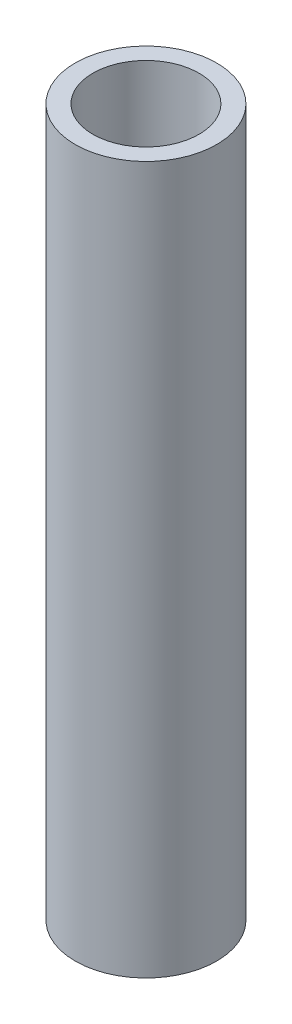
ISO-10303-21;
HEADER;
FILE_DESCRIPTION(('STEP AP214'),'2;1');
FILE_NAME('part.step','',(''),(''),'','','');
FILE_SCHEMA(('AUTOMOTIVE_DESIGN { 1 0 10303 214 1 1 1 1 }'));
ENDSEC;
DATA;
#1=APPLICATION_CONTEXT('core data for automotive mechanical design processes');
#2=APPLICATION_PROTOCOL_DEFINITION('international standard','automotive_design',2000,#1);
#3=PRODUCT_CONTEXT('',#1,'mechanical');
#4=PRODUCT('Part','Part','',(#3));
#5=PRODUCT_RELATED_PRODUCT_CATEGORY('part','',(#4));
#6=PRODUCT_DEFINITION_FORMATION('','',#4);
#7=PRODUCT_DEFINITION_CONTEXT('part definition',#1,'design');
#8=PRODUCT_DEFINITION('design','',#6,#7);
#9=PRODUCT_DEFINITION_SHAPE('','',#8);
#10=(LENGTH_UNIT() NAMED_UNIT(*) SI_UNIT(.MILLI.,.METRE.));
#11=(NAMED_UNIT(*) PLANE_ANGLE_UNIT() SI_UNIT($,.RADIAN.));
#12=(NAMED_UNIT(*) SI_UNIT($,.STERADIAN.) SOLID_ANGLE_UNIT());
#13=UNCERTAINTY_MEASURE_WITH_UNIT(LENGTH_MEASURE(1.E-05),#10,'distance_accuracy_value','');
#14=(GEOMETRIC_REPRESENTATION_CONTEXT(3) GLOBAL_UNCERTAINTY_ASSIGNED_CONTEXT((#13)) GLOBAL_UNIT_ASSIGNED_CONTEXT((#10,
#11,#12)) REPRESENTATION_CONTEXT('',''));
#15=CARTESIAN_POINT('',(0.,0.,0.));
#16=DIRECTION('',(0.,0.,1.));
#17=DIRECTION('',(1.,0.,0.));
#18=AXIS2_PLACEMENT_3D('',#15,#16,#17);
#19=CARTESIAN_POINT('',(0.,-20.,-8.));
#20=DIRECTION('',(0.,1.,0.));
#21=DIRECTION('',(0.,0.,1.));
#22=AXIS2_PLACEMENT_3D('',#19,#20,#21);
#23=CYLINDRICAL_SURFACE('',#22,4.);
#24=CARTESIAN_POINT('',(0.,-20.,-8.));
#25=DIRECTION('',(0.,1.,0.));
#26=DIRECTION('',(0.,0.,1.));
#27=AXIS2_PLACEMENT_3D('',#24,#25,#26);
#28=CIRCLE('',#27,4.);
#29=CARTESIAN_POINT('',(0.,-20.,-4.));
#30=VERTEX_POINT('',#29);
#31=EDGE_CURVE('E13',#30,#30,#28,.T.);
#32=ORIENTED_EDGE('',*,*,#31,.T.);
#33=EDGE_LOOP('',(#32));
#34=FACE_BOUND('',#33,.T.);
#35=CARTESIAN_POINT('',(0.,20.,-8.));
#36=DIRECTION('',(0.,1.,0.));
#37=DIRECTION('',(0.,0.,1.));
#38=AXIS2_PLACEMENT_3D('',#35,#36,#37);
#39=CIRCLE('',#38,4.);
#40=CARTESIAN_POINT('',(0.,20.,-4.));
#41=VERTEX_POINT('',#40);
#42=EDGE_CURVE('E339',#41,#41,#39,.T.);
#43=ORIENTED_EDGE('',*,*,#42,.F.);
#44=EDGE_LOOP('',(#43));
#45=FACE_BOUND('',#44,.T.);
#46=ADVANCED_FACE('F329',(#34,#45),#23,.T.);
#47=CARTESIAN_POINT('',(0.,-20.,-8.));
#48=DIRECTION('',(0.,1.,0.));
#49=DIRECTION('',(0.,0.,1.));
#50=AXIS2_PLACEMENT_3D('',#47,#48,#49);
#51=PLANE('',#50);
#52=ORIENTED_EDGE('',*,*,#31,.F.);
#53=EDGE_LOOP('',(#52));
#54=FACE_BOUND('',#53,.T.);
#55=CARTESIAN_POINT('',(0.,-20.,-8.));
#56=DIRECTION('',(0.,1.,0.));
#57=DIRECTION('',(0.,0.,1.));
#58=AXIS2_PLACEMENT_3D('',#55,#56,#57);
#59=CIRCLE('',#58,2.93);
#60=CARTESIAN_POINT('',(0.,-20.,-5.07));
#61=VERTEX_POINT('',#60);
#62=EDGE_CURVE('E465',#61,#61,#59,.T.);
#63=ORIENTED_EDGE('',*,*,#62,.T.);
#64=EDGE_LOOP('',(#63));
#65=FACE_BOUND('',#64,.T.);
#66=ADVANCED_FACE('F495',(#54,#65),#51,.F.);
#67=CARTESIAN_POINT('',(0.,-20.,-8.));
#68=DIRECTION('',(0.,1.,0.));
#69=DIRECTION('',(0.,0.,1.));
#70=AXIS2_PLACEMENT_3D('',#67,#68,#69);
#71=CYLINDRICAL_SURFACE('',#70,3.);
#72=CARTESIAN_POINT('',(-2.12132034355964,-2.,-10.1213203435596));
#73=CARTESIAN_POINT('',(-2.39905187956295,-1.35654769278127,-9.84358880755633));
#74=CARTESIAN_POINT('',(-2.62133129650301,-0.713452557221748,-9.51092416955828));
#75=CARTESIAN_POINT('',(-2.77163853913441,-0.0700002500030154,-9.14805043808401));
#76=B_SPLINE_CURVE_WITH_KNOTS('',3,(#72,#73,#74,#75),.UNSPECIFIED.,.F.,.F.,(4,4),(0.,
0.999999870464756),.UNSPECIFIED.);
#77=CARTESIAN_POINT('',(-2.12132034355964,-2.,-10.1213203435596));
#78=VERTEX_POINT('',#77);
#79=CARTESIAN_POINT('',(-2.77163859753386,-0.0700000000000006,-9.14805029709527));
#80=VERTEX_POINT('',#79);
#81=EDGE_CURVE('E567',#78,#80,#76,.T.);
#82=ORIENTED_EDGE('',*,*,#81,.F.);
#83=CARTESIAN_POINT('',(-1.14805029709527,-0.0700000000000006,-10.7716385975339));
#84=CARTESIAN_POINT('',(-1.51092403621543,-0.713452307218729,-10.6213313733613));
#85=CARTESIAN_POINT('',(-1.84358868552047,-1.35654744277825,-10.3990519733433));
#86=CARTESIAN_POINT('',(-2.12132023565153,-1.99999974999698,-10.1213204514677));
#87=B_SPLINE_CURVE_WITH_KNOTS('',3,(#83,#84,#85,#86),.UNSPECIFIED.,.F.,.F.,(4,4),(0.,
0.999999870464756),.UNSPECIFIED.);
#88=CARTESIAN_POINT('',(-1.14805029709527,-0.0700000000000006,-10.7716385975339));
#89=VERTEX_POINT('',#88);
#90=EDGE_CURVE('E576',#89,#78,#87,.T.);
#91=ORIENTED_EDGE('',*,*,#90,.F.);
#92=CARTESIAN_POINT('',(0.,-2.,-11.));
#93=CARTESIAN_POINT('',(-0.392771704914593,-1.35654769278127,-11.));
#94=CARTESIAN_POINT('',(-0.785176409340493,-0.713452557221746,-10.9219458616471));
#95=CARTESIAN_POINT('',(-1.14805015610653,-0.0700002500030154,-10.7716386559333));
#96=B_SPLINE_CURVE_WITH_KNOTS('',3,(#92,#93,#94,#95),.UNSPECIFIED.,.F.,.F.,(4,4),(0.,
0.999999870464756),.UNSPECIFIED.);
#97=CARTESIAN_POINT('',(0.,-2.,-11.));
#98=VERTEX_POINT('',#97);
#99=EDGE_CURVE('E476',#98,#89,#96,.T.);
#100=ORIENTED_EDGE('',*,*,#99,.F.);
#101=CARTESIAN_POINT('',(1.14805029709522,-0.0699999999999763,-10.7716385975339));
#102=CARTESIAN_POINT('',(0.785176510936503,-0.7134523906281,-10.9219458411905));
#103=CARTESIAN_POINT('',(0.392771755828739,-1.35654760937188,-11.));
#104=CARTESIAN_POINT('',(0.,-2.,-11.));
#105=B_SPLINE_CURVE_WITH_KNOTS('',3,(#101,#102,#103,#104),.UNSPECIFIED.,.F.,.F.,(4,4),(0.,1.),.UNSPECIFIED.);
#106=CARTESIAN_POINT('',(1.14805029709522,-0.0699999999999763,-10.7716385975339));
#107=VERTEX_POINT('',#106);
#108=EDGE_CURVE('E347',#107,#98,#105,.T.);
#109=ORIENTED_EDGE('',*,*,#108,.F.);
#110=CARTESIAN_POINT('',(2.12132034355963,-2.,-10.1213203435597));
#111=CARTESIAN_POINT('',(1.84358880755631,-1.35654769278127,-10.399051879563));
#112=CARTESIAN_POINT('',(1.51092416955824,-0.71345255722173,-10.621331296503));
#113=CARTESIAN_POINT('',(1.14805043808396,-0.0700002500029981,-10.7716385391344));
#114=B_SPLINE_CURVE_WITH_KNOTS('',3,(#110,#111,#112,#113),.UNSPECIFIED.,.F.,.F.,(4,4),(0.,
0.999999870464757),.UNSPECIFIED.);
#115=CARTESIAN_POINT('',(2.12132034355963,-2.,-10.1213203435597));
#116=VERTEX_POINT('',#115);
#117=EDGE_CURVE('E456',#116,#107,#114,.T.);
#118=ORIENTED_EDGE('',*,*,#117,.F.);
#119=CARTESIAN_POINT('',(2.77163859753386,-0.0699999999999971,-9.14805029709527));
#120=CARTESIAN_POINT('',(2.62133137336125,-0.713452307218725,-9.51092403621543));
#121=CARTESIAN_POINT('',(2.3990519733433,-1.35654744277825,-9.84358868552048));
#122=CARTESIAN_POINT('',(2.12132045146774,-1.99999974999698,-10.1213202356515));
#123=B_SPLINE_CURVE_WITH_KNOTS('',3,(#119,#120,#121,#122),.UNSPECIFIED.,.F.,.F.,(4,4),(0.,
0.999999870464757),.UNSPECIFIED.);
#124=CARTESIAN_POINT('',(2.77163859753386,-0.0699999999999971,-9.14805029709527));
#125=VERTEX_POINT('',#124);
#126=EDGE_CURVE('E466',#125,#116,#123,.T.);
#127=ORIENTED_EDGE('',*,*,#126,.F.);
#128=CARTESIAN_POINT('',(3.,-2.,-8.));
#129=CARTESIAN_POINT('',(3.,-1.35654769278128,-8.39277170491459));
#130=CARTESIAN_POINT('',(2.92194586164711,-0.713452557221746,-8.78517640934049));
#131=CARTESIAN_POINT('',(2.77163865593331,-0.0700002500030189,-9.14805015610653));
#132=B_SPLINE_CURVE_WITH_KNOTS('',3,(#128,#129,#130,#131),.UNSPECIFIED.,.F.,.F.,(4,4),(0.,
0.999999870464757),.UNSPECIFIED.);
#133=CARTESIAN_POINT('',(3.,-2.,-8.));
#134=VERTEX_POINT('',#133);
#135=EDGE_CURVE('E752',#134,#125,#132,.T.);
#136=ORIENTED_EDGE('',*,*,#135,.F.);
#137=CARTESIAN_POINT('',(2.77163859753386,-0.0699999999999971,-6.85194970290473));
#138=CARTESIAN_POINT('',(2.92194582170646,-0.713452307218721,-7.21482344202488));
#139=CARTESIAN_POINT('',(2.99999998002034,-1.35654744277825,-7.6072281424803));
#140=CARTESIAN_POINT('',(3.,-1.99999974999698,-7.99999984739489));
#141=B_SPLINE_CURVE_WITH_KNOTS('',3,(#137,#138,#139,#140),.UNSPECIFIED.,.F.,.F.,(4,4),(0.,
0.999999870464757),.UNSPECIFIED.);
#142=CARTESIAN_POINT('',(2.77163859753386,-0.0699999999999971,-6.85194970290473));
#143=VERTEX_POINT('',#142);
#144=EDGE_CURVE('E1434',#143,#134,#141,.T.);
#145=ORIENTED_EDGE('',*,*,#144,.F.);
#146=CARTESIAN_POINT('',(2.12132034355964,-2.,-5.87867965644036));
#147=CARTESIAN_POINT('',(2.39905187956295,-1.35654769278128,-6.15641119244366));
#148=CARTESIAN_POINT('',(2.62133129650301,-0.713452557221744,-6.48907583044173));
#149=CARTESIAN_POINT('',(2.77163853913441,-0.0700002500030189,-6.85194956191599));
#150=B_SPLINE_CURVE_WITH_KNOTS('',3,(#146,#147,#148,#149),.UNSPECIFIED.,.F.,.F.,(4,4),(0.,
0.999999870464757),.UNSPECIFIED.);
#151=CARTESIAN_POINT('',(2.12132034355964,-2.,-5.87867965644036));
#152=VERTEX_POINT('',#151);
#153=EDGE_CURVE('E1400',#152,#143,#150,.T.);
#154=ORIENTED_EDGE('',*,*,#153,.F.);
#155=CARTESIAN_POINT('',(1.14805029709527,-0.0699999999999971,-5.22836140246614));
#156=CARTESIAN_POINT('',(1.51092403621542,-0.713452307218724,-5.37866862663874));
#157=CARTESIAN_POINT('',(1.84358868552047,-1.35654744277825,-5.60094802665669));
#158=CARTESIAN_POINT('',(2.12132023565153,-1.99999974999698,-5.87867954853225));
#159=B_SPLINE_CURVE_WITH_KNOTS('',3,(#155,#156,#157,#158),.UNSPECIFIED.,.F.,.F.,(4,4),(0.,
0.999999870464757),.UNSPECIFIED.);
#160=CARTESIAN_POINT('',(1.14805029709527,-0.0699999999999971,-5.22836140246614));
#161=VERTEX_POINT('',#160);
#162=EDGE_CURVE('E1410',#161,#152,#159,.T.);
#163=ORIENTED_EDGE('',*,*,#162,.F.);
#164=CARTESIAN_POINT('',(0.,-2.,-5.));
#165=CARTESIAN_POINT('',(0.392771704914587,-1.35654769278128,-5.));
#166=CARTESIAN_POINT('',(0.785176409340494,-0.71345255722174,-5.07805413835289));
#167=CARTESIAN_POINT('',(1.14805015610653,-0.0700002500030154,-5.22836134406669));
#168=B_SPLINE_CURVE_WITH_KNOTS('',3,(#164,#165,#166,#167),.UNSPECIFIED.,.F.,.F.,(4,4),(0.,
0.999999870464757),.UNSPECIFIED.);
#169=CARTESIAN_POINT('',(0.,-2.,-5.));
#170=VERTEX_POINT('',#169);
#171=EDGE_CURVE('E906',#170,#161,#168,.T.);
#172=ORIENTED_EDGE('',*,*,#171,.F.);
#173=CARTESIAN_POINT('',(-1.14805029709527,-0.0700000000000006,-5.22836140246614));
#174=CARTESIAN_POINT('',(-0.78517655797512,-0.713452307218726,-5.07805417829354));
#175=CARTESIAN_POINT('',(-0.392771857519706,-1.35654744277825,-5.00000001997966));
#176=CARTESIAN_POINT('',(-1.5260511594599E-07,-1.99999974999698,-5.));
#177=B_SPLINE_CURVE_WITH_KNOTS('',3,(#173,#174,#175,#176),.UNSPECIFIED.,.F.,.F.,(4,4),(0.,
0.999999870464756),.UNSPECIFIED.);
#178=CARTESIAN_POINT('',(-1.14805029709527,-0.0700000000000006,-5.22836140246614));
#179=VERTEX_POINT('',#178);
#180=EDGE_CURVE('E1455',#179,#170,#177,.T.);
#181=ORIENTED_EDGE('',*,*,#180,.F.);
#182=CARTESIAN_POINT('',(-2.12132034355965,-2.,-5.87867965644036));
#183=CARTESIAN_POINT('',(-1.84358880755633,-1.35654769278126,-5.60094812043705));
#184=CARTESIAN_POINT('',(-1.51092416955828,-0.713452557221748,-5.37866870349699));
#185=CARTESIAN_POINT('',(-1.14805043808401,-0.0700002500030154,-5.22836146086559));
#186=B_SPLINE_CURVE_WITH_KNOTS('',3,(#182,#183,#184,#185),.UNSPECIFIED.,.F.,.F.,(4,4),(0.,
0.999999870464756),.UNSPECIFIED.);
#187=CARTESIAN_POINT('',(-2.12132034355965,-2.,-5.87867965644036));
#188=VERTEX_POINT('',#187);
#189=EDGE_CURVE('E1459',#188,#179,#186,.T.);
#190=ORIENTED_EDGE('',*,*,#189,.F.);
#191=CARTESIAN_POINT('',(-2.77163859753386,-0.0700000000000006,-6.85194970290473));
#192=CARTESIAN_POINT('',(-2.62133137336126,-0.71345230721873,-6.48907596378458));
#193=CARTESIAN_POINT('',(-2.39905197334331,-1.35654744277825,-6.15641131447953));
#194=CARTESIAN_POINT('',(-2.12132045146775,-1.99999974999698,-5.87867976434847));
#195=B_SPLINE_CURVE_WITH_KNOTS('',3,(#191,#192,#193,#194),.UNSPECIFIED.,.F.,.F.,(4,4),(0.,
0.999999870464756),.UNSPECIFIED.);
#196=CARTESIAN_POINT('',(-2.77163859753386,-0.0700000000000006,-6.85194970290473));
#197=VERTEX_POINT('',#196);
#198=EDGE_CURVE('E1463',#197,#188,#195,.T.);
#199=ORIENTED_EDGE('',*,*,#198,.F.);
#200=CARTESIAN_POINT('',(-3.,-2.,-8.));
#201=CARTESIAN_POINT('',(-3.,-1.35654769278127,-7.60722829508541));
#202=CARTESIAN_POINT('',(-2.92194586164711,-0.713452557221749,-7.21482359065951));
#203=CARTESIAN_POINT('',(-2.77163865593331,-0.0700002500030154,-6.85194984389347));
#204=B_SPLINE_CURVE_WITH_KNOTS('',3,(#200,#201,#202,#203),.UNSPECIFIED.,.F.,.F.,(4,4),(0.,
0.999999870464756),.UNSPECIFIED.);
#205=CARTESIAN_POINT('',(-3.,-2.,-8.));
#206=VERTEX_POINT('',#205);
#207=EDGE_CURVE('E1061',#206,#197,#204,.T.);
#208=ORIENTED_EDGE('',*,*,#207,.F.);
#209=CARTESIAN_POINT('',(-2.77163859753386,-0.0700000000000006,-9.14805029709527));
#210=CARTESIAN_POINT('',(-2.92194582170646,-0.713452307218727,-8.78517655797512));
#211=CARTESIAN_POINT('',(-2.99999998002034,-1.35654744277825,-8.3927718575197));
#212=CARTESIAN_POINT('',(-3.,-1.99999974999698,-8.00000015260512));
#213=B_SPLINE_CURVE_WITH_KNOTS('',3,(#209,#210,#211,#212),.UNSPECIFIED.,.F.,.F.,(4,4),(0.,
0.999999870464756),.UNSPECIFIED.);
#214=EDGE_CURVE('E584',#80,#206,#213,.T.);
#215=ORIENTED_EDGE('',*,*,#214,.F.);
#216=EDGE_LOOP('',(#82,#91,#100,#109,#118,#127,#136,#145,#154,#163,#172,#181,#190,#199,#208,#215));
#217=FACE_BOUND('',#216,.T.);
#218=CARTESIAN_POINT('',(0.,20.,-8.));
#219=DIRECTION('',(0.,1.,0.));
#220=DIRECTION('',(0.,0.,1.));
#221=AXIS2_PLACEMENT_3D('',#218,#219,#220);
#222=CIRCLE('',#221,3.);
#223=CARTESIAN_POINT('',(0.,20.,-5.));
#224=VERTEX_POINT('',#223);
#225=EDGE_CURVE('E1168',#224,#224,#222,.T.);
#226=ORIENTED_EDGE('',*,*,#225,.T.);
#227=EDGE_LOOP('',(#226));
#228=FACE_BOUND('',#227,.T.);
#229=ADVANCED_FACE('F472',(#217,#228),#71,.F.);
#230=CARTESIAN_POINT('',(0.,20.,-8.));
#231=DIRECTION('',(0.,1.,0.));
#232=DIRECTION('',(0.,0.,1.));
#233=AXIS2_PLACEMENT_3D('',#230,#231,#232);
#234=PLANE('',#233);
#235=ORIENTED_EDGE('',*,*,#42,.T.);
#236=EDGE_LOOP('',(#235));
#237=FACE_BOUND('',#236,.T.);
#238=ORIENTED_EDGE('',*,*,#225,.F.);
#239=EDGE_LOOP('',(#238));
#240=FACE_BOUND('',#239,.T.);
#241=ADVANCED_FACE('F494',(#237,#240),#234,.T.);
#242=CARTESIAN_POINT('',(-1.14805029709527,-0.0700000000000006,-10.7716385975339));
#243=CARTESIAN_POINT('',(-1.51092403621543,-0.713452307218729,-10.6213313733613));
#244=CARTESIAN_POINT('',(-1.84358868552047,-1.35654744277825,-10.3990519733433));
#245=CARTESIAN_POINT('',(-2.12132023565153,-1.99999974999698,-10.1213204514677));
#246=CARTESIAN_POINT('',(-1.12126245682972,-0.0700000000000006,-10.7069670302581));
#247=CARTESIAN_POINT('',(-1.47566703737391,-0.713448486042603,-10.5601678464295));
#248=CARTESIAN_POINT('',(-1.80057322703118,-1.35655126395438,-10.3430724831259));
#249=CARTESIAN_POINT('',(-2.07182276348633,-1.99999974999698,-10.0718229742668));
#250=B_SPLINE_SURFACE_WITH_KNOTS('',1,3,((#242,#243,#244,#245),(#246,#247,#248,#249)),
.UNSPECIFIED.,.F.,.F.,.F.,(2,2),(4,4),(0.,1.),(0.,0.999999870464756),.UNSPECIFIED.);
#251=CARTESIAN_POINT('',(-1.14805015610653,-0.0700002500030154,-10.7716386559333));
#252=CARTESIAN_POINT('',(-1.12126231913071,-0.0700002500030154,-10.7069670872949));
#253=B_SPLINE_CURVE_WITH_KNOTS('',1,(#251,#252),.UNSPECIFIED.,.F.,.F.,(2,2),(0.,1.),.UNSPECIFIED.);
#254=CARTESIAN_POINT('',(-1.12126245682972,-0.0700000000000006,-10.7069670302581));
#255=VERTEX_POINT('',#254);
#256=EDGE_CURVE('E591',#89,#255,#253,.T.);
#257=CARTESIAN_POINT('',(-2.12132023565153,-1.99999974999698,-10.1213204514677));
#258=CARTESIAN_POINT('',(-2.07182276348633,-1.99999974999698,-10.0718229742668));
#259=B_SPLINE_CURVE_WITH_KNOTS('',1,(#257,#258),.UNSPECIFIED.,.F.,.F.,(2,2),(0.,1.),.UNSPECIFIED.);
#260=CARTESIAN_POINT('',(-2.07182286887658,-2.,-10.0718228688766));
#261=VERTEX_POINT('',#260);
#262=EDGE_CURVE('E1149',#78,#261,#259,.T.);
#263=CARTESIAN_POINT('',(-2.07182276348633,-1.99999974999698,-10.0718229742668));
#264=CARTESIAN_POINT('',(-1.80057322703118,-1.35655126395438,-10.3430724831259));
#265=CARTESIAN_POINT('',(-1.47566703737391,-0.713448486042603,-10.5601678464295));
#266=CARTESIAN_POINT('',(-1.12126245682972,-0.0700000000000006,-10.7069670302581));
#267=B_SPLINE_CURVE_WITH_KNOTS('',3,(#263,#264,#265,#266),.UNSPECIFIED.,.F.,.F.,(4,4),(0.,
0.999999870464756),.UNSPECIFIED.);
#268=EDGE_CURVE('E1233',#255,#261,#267,.F.);
#269=ORIENTED_EDGE('',*,*,#256,.F.);
#270=ORIENTED_EDGE('',*,*,#90,.T.);
#271=ORIENTED_EDGE('',*,*,#262,.T.);
#272=ORIENTED_EDGE('',*,*,#268,.F.);
#273=EDGE_LOOP('',(#269,#270,#271,#272));
#274=FACE_BOUND('',#273,.T.);
#275=ADVANCED_FACE('F613',(#274),#250,.F.);
#276=CARTESIAN_POINT('',(-2.12132034355964,-2.,-10.1213203435596));
#277=CARTESIAN_POINT('',(-2.39905187956295,-1.35654769278127,-9.84358880755633));
#278=CARTESIAN_POINT('',(-2.62133129650301,-0.713452557221748,-9.51092416955828));
#279=CARTESIAN_POINT('',(-2.77163853913441,-0.0700002500030154,-9.14805043808401));
#280=CARTESIAN_POINT('',(-2.07182286887658,-2.,-10.0718228688766));
#281=CARTESIAN_POINT('',(-2.34307239153371,-1.35655151395739,-9.80057334621946));
#282=CARTESIAN_POINT('',(-2.56016777136474,-0.71344873604562,-9.47566716760547));
#283=CARTESIAN_POINT('',(-2.70696697322127,-0.0700002500030154,-9.12126259452871));
#284=B_SPLINE_SURFACE_WITH_KNOTS('',1,3,((#276,#277,#278,#279),(#280,#281,#282,#283)),
.UNSPECIFIED.,.F.,.F.,.F.,(2,2),(4,4),(0.,1.),(0.,0.999999870464756),.UNSPECIFIED.);
#285=CARTESIAN_POINT('',(-2.77163853913441,-0.0700002500030154,-9.14805043808401));
#286=CARTESIAN_POINT('',(-2.70696697322127,-0.0700002500030154,-9.12126259452871));
#287=B_SPLINE_CURVE_WITH_KNOTS('',1,(#285,#286),.UNSPECIFIED.,.F.,.F.,(2,2),(0.,1.),.UNSPECIFIED.);
#288=CARTESIAN_POINT('',(-2.70696703025807,-0.0700000000000006,-9.12126245682971));
#289=VERTEX_POINT('',#288);
#290=EDGE_CURVE('E1130',#80,#289,#287,.T.);
#291=CARTESIAN_POINT('',(-2.70696697322127,-0.0700002500030154,-9.12126259452871));
#292=CARTESIAN_POINT('',(-2.56016777136474,-0.71344873604562,-9.47566716760547));
#293=CARTESIAN_POINT('',(-2.34307239153371,-1.35655151395739,-9.80057334621946));
#294=CARTESIAN_POINT('',(-2.07182286887658,-2.,-10.0718228688766));
#295=B_SPLINE_CURVE_WITH_KNOTS('',3,(#291,#292,#293,#294),.UNSPECIFIED.,.F.,.F.,(4,4),(0.,
0.999999870464756),.UNSPECIFIED.);
#296=EDGE_CURVE('E1167',#261,#289,#295,.F.);
#297=ORIENTED_EDGE('',*,*,#262,.F.);
#298=ORIENTED_EDGE('',*,*,#81,.T.);
#299=ORIENTED_EDGE('',*,*,#290,.T.);
#300=ORIENTED_EDGE('',*,*,#296,.F.);
#301=EDGE_LOOP('',(#297,#298,#299,#300));
#302=FACE_BOUND('',#301,.T.);
#303=ADVANCED_FACE('F1091',(#302),#284,.F.);
#304=CARTESIAN_POINT('',(-2.77163859753386,-0.0700000000000006,-9.14805029709527));
#305=CARTESIAN_POINT('',(-2.92194582170646,-0.713452307218727,-8.78517655797512));
#306=CARTESIAN_POINT('',(-2.99999998002034,-1.35654744277825,-8.3927718575197));
#307=CARTESIAN_POINT('',(-3.,-1.99999974999698,-8.00000015260512));
#308=CARTESIAN_POINT('',(-2.70696703025807,-0.0700000000000006,-9.12126245682971));
#309=CARTESIAN_POINT('',(-2.85376621408662,-0.713448486042599,-8.76685787628552));
#310=CARTESIAN_POINT('',(-2.92999998048665,-1.35655126395438,-8.38360490277326));
#311=CARTESIAN_POINT('',(-2.93,-1.99999974999698,-8.00000014904433));
#312=B_SPLINE_SURFACE_WITH_KNOTS('',1,3,((#304,#305,#306,#307),(#308,#309,#310,#311)),
.UNSPECIFIED.,.F.,.F.,.F.,(2,2),(4,4),(0.,1.),(0.,0.999999870464756),.UNSPECIFIED.);
#313=CARTESIAN_POINT('',(-3.,-1.99999974999698,-8.00000015260512));
#314=CARTESIAN_POINT('',(-2.93,-1.99999974999698,-8.00000014904433));
#315=B_SPLINE_CURVE_WITH_KNOTS('',1,(#313,#314),.UNSPECIFIED.,.F.,.F.,(2,2),(0.,1.),.UNSPECIFIED.);
#316=CARTESIAN_POINT('',(-2.93,-2.,-8.));
#317=VERTEX_POINT('',#316);
#318=EDGE_CURVE('E1118',#206,#317,#315,.T.);
#319=CARTESIAN_POINT('',(-2.93,-1.99999974999698,-8.00000014904433));
#320=CARTESIAN_POINT('',(-2.92999998048665,-1.35655126395438,-8.38360490277326));
#321=CARTESIAN_POINT('',(-2.85376621408662,-0.713448486042599,-8.76685787628552));
#322=CARTESIAN_POINT('',(-2.70696703025807,-0.0700000000000006,-9.12126245682971));
#323=B_SPLINE_CURVE_WITH_KNOTS('',3,(#319,#320,#321,#322),.UNSPECIFIED.,.F.,.F.,(4,4),(0.,
0.999999870464756),.UNSPECIFIED.);
#324=EDGE_CURVE('E1075',#289,#317,#323,.F.);
#325=ORIENTED_EDGE('',*,*,#290,.F.);
#326=ORIENTED_EDGE('',*,*,#214,.T.);
#327=ORIENTED_EDGE('',*,*,#318,.T.);
#328=ORIENTED_EDGE('',*,*,#324,.F.);
#329=EDGE_LOOP('',(#325,#326,#327,#328));
#330=FACE_BOUND('',#329,.T.);
#331=ADVANCED_FACE('F1081',(#330),#312,.F.);
#332=CARTESIAN_POINT('',(-3.,-2.,-8.));
#333=CARTESIAN_POINT('',(-3.,-1.35654769278127,-7.60722829508541));
#334=CARTESIAN_POINT('',(-2.92194586164711,-0.713452557221749,-7.21482359065951));
#335=CARTESIAN_POINT('',(-2.77163865593331,-0.0700002500030154,-6.85194984389347));
#336=CARTESIAN_POINT('',(-2.93,-2.,-8.));
#337=CARTESIAN_POINT('',(-2.93,-1.3565515139574,-7.61639524627107));
#338=CARTESIAN_POINT('',(-2.85376625309543,-0.713448736045621,-7.23314226888092));
#339=CARTESIAN_POINT('',(-2.70696708729486,-0.0700002500030154,-6.87873768086929));
#340=B_SPLINE_SURFACE_WITH_KNOTS('',1,3,((#332,#333,#334,#335),(#336,#337,#338,#339)),
.UNSPECIFIED.,.F.,.F.,.F.,(2,2),(4,4),(0.,1.),(0.,0.999999870464756),.UNSPECIFIED.);
#341=CARTESIAN_POINT('',(-2.77163865593331,-0.0700002500030154,-6.85194984389347));
#342=CARTESIAN_POINT('',(-2.70696708729486,-0.0700002500030154,-6.87873768086929));
#343=B_SPLINE_CURVE_WITH_KNOTS('',1,(#341,#342),.UNSPECIFIED.,.F.,.F.,(2,2),(0.,1.),.UNSPECIFIED.);
#344=CARTESIAN_POINT('',(-2.70696703025807,-0.0700000000000006,-6.87873754317029));
#345=VERTEX_POINT('',#344);
#346=EDGE_CURVE('E1169',#197,#345,#343,.T.);
#347=CARTESIAN_POINT('',(-2.70696708729486,-0.0700002500030154,-6.87873768086929));
#348=CARTESIAN_POINT('',(-2.85376625309543,-0.713448736045621,-7.23314226888092));
#349=CARTESIAN_POINT('',(-2.93,-1.3565515139574,-7.61639524627107));
#350=CARTESIAN_POINT('',(-2.93,-2.,-8.));
#351=B_SPLINE_CURVE_WITH_KNOTS('',3,(#347,#348,#349,#350),.UNSPECIFIED.,.F.,.F.,(4,4),(0.,
0.999999870464756),.UNSPECIFIED.);
#352=EDGE_CURVE('E1049',#317,#345,#351,.F.);
#353=ORIENTED_EDGE('',*,*,#318,.F.);
#354=ORIENTED_EDGE('',*,*,#207,.T.);
#355=ORIENTED_EDGE('',*,*,#346,.T.);
#356=ORIENTED_EDGE('',*,*,#352,.F.);
#357=EDGE_LOOP('',(#353,#354,#355,#356));
#358=FACE_BOUND('',#357,.T.);
#359=ADVANCED_FACE('F1017',(#358),#340,.F.);
#360=CARTESIAN_POINT('',(-2.77163859753386,-0.0700000000000006,-6.85194970290473));
#361=CARTESIAN_POINT('',(-2.62133137336126,-0.71345230721873,-6.48907596378458));
#362=CARTESIAN_POINT('',(-2.39905197334331,-1.35654744277825,-6.15641131447953));
#363=CARTESIAN_POINT('',(-2.12132045146775,-1.99999974999698,-5.87867976434847));
#364=CARTESIAN_POINT('',(-2.70696703025807,-0.0700000000000006,-6.87873754317029));
#365=CARTESIAN_POINT('',(-2.56016784642952,-0.713448486042598,-6.5243329626261));
#366=CARTESIAN_POINT('',(-2.34307248312594,-1.35655126395438,-6.19942677296882));
#367=CARTESIAN_POINT('',(-2.07182297426684,-1.99999974999698,-5.92817723651368));
#368=B_SPLINE_SURFACE_WITH_KNOTS('',1,3,((#360,#361,#362,#363),(#364,#365,#366,#367)),
.UNSPECIFIED.,.F.,.F.,.F.,(2,2),(4,4),(0.,1.),(0.,0.999999870464756),.UNSPECIFIED.);
#369=CARTESIAN_POINT('',(-2.12132045146775,-1.99999974999698,-5.87867976434847));
#370=CARTESIAN_POINT('',(-2.07182297426684,-1.99999974999698,-5.92817723651368));
#371=B_SPLINE_CURVE_WITH_KNOTS('',1,(#369,#370),.UNSPECIFIED.,.F.,.F.,(2,2),(0.,1.),.UNSPECIFIED.);
#372=CARTESIAN_POINT('',(-2.07182286887659,-2.,-5.92817713112342));
#373=VERTEX_POINT('',#372);
#374=EDGE_CURVE('E1000',#188,#373,#371,.T.);
#375=CARTESIAN_POINT('',(-2.07182297426684,-1.99999974999698,-5.92817723651368));
#376=CARTESIAN_POINT('',(-2.34307248312594,-1.35655126395438,-6.19942677296882));
#377=CARTESIAN_POINT('',(-2.56016784642952,-0.713448486042598,-6.5243329626261));
#378=CARTESIAN_POINT('',(-2.70696703025807,-0.0700000000000006,-6.87873754317029));
#379=B_SPLINE_CURVE_WITH_KNOTS('',3,(#375,#376,#377,#378),.UNSPECIFIED.,.F.,.F.,(4,4),(0.,
0.999999870464756),.UNSPECIFIED.);
#380=EDGE_CURVE('E1250',#345,#373,#379,.F.);
#381=ORIENTED_EDGE('',*,*,#346,.F.);
#382=ORIENTED_EDGE('',*,*,#198,.T.);
#383=ORIENTED_EDGE('',*,*,#374,.T.);
#384=ORIENTED_EDGE('',*,*,#380,.F.);
#385=EDGE_LOOP('',(#381,#382,#383,#384));
#386=FACE_BOUND('',#385,.T.);
#387=ADVANCED_FACE('F1006',(#386),#368,.F.);
#388=CARTESIAN_POINT('',(-2.12132034355965,-2.,-5.87867965644036));
#389=CARTESIAN_POINT('',(-1.84358880755633,-1.35654769278126,-5.60094812043705));
#390=CARTESIAN_POINT('',(-1.51092416955828,-0.713452557221748,-5.37866870349699));
#391=CARTESIAN_POINT('',(-1.14805043808401,-0.0700002500030154,-5.22836146086559));
#392=CARTESIAN_POINT('',(-2.07182286887659,-2.,-5.92817713112342));
#393=CARTESIAN_POINT('',(-1.80057334621946,-1.35655151395739,-5.65692760846629));
#394=CARTESIAN_POINT('',(-1.47566716760547,-0.713448736045619,-5.43983222863526));
#395=CARTESIAN_POINT('',(-1.12126259452872,-0.0700002500030154,-5.29303302677873));
#396=B_SPLINE_SURFACE_WITH_KNOTS('',1,3,((#388,#389,#390,#391),(#392,#393,#394,#395)),
.UNSPECIFIED.,.F.,.F.,.F.,(2,2),(4,4),(0.,1.),(0.,0.999999870464756),.UNSPECIFIED.);
#397=CARTESIAN_POINT('',(-1.14805043808401,-0.0700002500030154,-5.22836146086559));
#398=CARTESIAN_POINT('',(-1.12126259452872,-0.0700002500030154,-5.29303302677873));
#399=B_SPLINE_CURVE_WITH_KNOTS('',1,(#397,#398),.UNSPECIFIED.,.F.,.F.,(2,2),(0.,1.),.UNSPECIFIED.);
#400=CARTESIAN_POINT('',(-1.12126245682971,-0.0700000000000006,-5.29303296974193));
#401=VERTEX_POINT('',#400);
#402=EDGE_CURVE('E978',#179,#401,#399,.T.);
#403=CARTESIAN_POINT('',(-1.12126259452872,-0.0700002500030154,-5.29303302677873));
#404=CARTESIAN_POINT('',(-1.47566716760547,-0.713448736045619,-5.43983222863526));
#405=CARTESIAN_POINT('',(-1.80057334621946,-1.35655151395739,-5.65692760846629));
#406=CARTESIAN_POINT('',(-2.07182286887659,-2.,-5.92817713112342));
#407=B_SPLINE_CURVE_WITH_KNOTS('',3,(#403,#404,#405,#406),.UNSPECIFIED.,.F.,.F.,(4,4),(0.,
0.999999870464756),.UNSPECIFIED.);
#408=EDGE_CURVE('E1255',#373,#401,#407,.F.);
#409=ORIENTED_EDGE('',*,*,#374,.F.);
#410=ORIENTED_EDGE('',*,*,#189,.T.);
#411=ORIENTED_EDGE('',*,*,#402,.T.);
#412=ORIENTED_EDGE('',*,*,#408,.F.);
#413=EDGE_LOOP('',(#409,#410,#411,#412));
#414=FACE_BOUND('',#413,.T.);
#415=ADVANCED_FACE('F937',(#414),#396,.F.);
#416=CARTESIAN_POINT('',(-1.14805029709527,-0.0700000000000006,-5.22836140246614));
#417=CARTESIAN_POINT('',(-0.78517655797512,-0.713452307218726,-5.07805417829354));
#418=CARTESIAN_POINT('',(-0.392771857519706,-1.35654744277825,-5.00000001997966));
#419=CARTESIAN_POINT('',(-1.5260511594599E-07,-1.99999974999698,-5.));
#420=CARTESIAN_POINT('',(-1.12126245682972,-0.0700000000000006,-5.29303296974193));
#421=CARTESIAN_POINT('',(-0.766857876285524,-0.7134484860426,-5.14623378591338));
#422=CARTESIAN_POINT('',(-0.38360490277326,-1.35655126395438,-5.07000001951335));
#423=CARTESIAN_POINT('',(-1.4904432990725E-07,-1.99999974999698,-5.07));
#424=B_SPLINE_SURFACE_WITH_KNOTS('',1,3,((#416,#417,#418,#419),(#420,#421,#422,#423)),
.UNSPECIFIED.,.F.,.F.,.F.,(2,2),(4,4),(0.,1.),(0.,0.999999870464756),.UNSPECIFIED.);
#425=CARTESIAN_POINT('',(-1.5260511594599E-07,-1.99999974999698,-5.));
#426=CARTESIAN_POINT('',(-1.4904432990725E-07,-1.99999974999698,-5.07));
#427=B_SPLINE_CURVE_WITH_KNOTS('',1,(#425,#426),.UNSPECIFIED.,.F.,.F.,(2,2),(0.,1.),.UNSPECIFIED.);
#428=CARTESIAN_POINT('',(0.,-2.,-5.07));
#429=VERTEX_POINT('',#428);
#430=EDGE_CURVE('E965',#170,#429,#427,.T.);
#431=CARTESIAN_POINT('',(-1.4904432990725E-07,-1.99999974999698,-5.07));
#432=CARTESIAN_POINT('',(-0.38360490277326,-1.35655126395438,-5.07000001951335));
#433=CARTESIAN_POINT('',(-0.766857876285524,-0.7134484860426,-5.14623378591338));
#434=CARTESIAN_POINT('',(-1.12126245682972,-0.0700000000000006,-5.29303296974193));
#435=B_SPLINE_CURVE_WITH_KNOTS('',3,(#431,#432,#433,#434),.UNSPECIFIED.,.F.,.F.,(4,4),(0.,
0.999999870464756),.UNSPECIFIED.);
#436=EDGE_CURVE('E920',#401,#429,#435,.F.);
#437=ORIENTED_EDGE('',*,*,#402,.F.);
#438=ORIENTED_EDGE('',*,*,#180,.T.);
#439=ORIENTED_EDGE('',*,*,#430,.T.);
#440=ORIENTED_EDGE('',*,*,#436,.F.);
#441=EDGE_LOOP('',(#437,#438,#439,#440));
#442=FACE_BOUND('',#441,.T.);
#443=ADVANCED_FACE('F926',(#442),#424,.F.);
#444=CARTESIAN_POINT('',(0.,-2.,-5.));
#445=CARTESIAN_POINT('',(0.392771704914587,-1.35654769278128,-5.));
#446=CARTESIAN_POINT('',(0.785176409340494,-0.71345255722174,-5.07805413835289));
#447=CARTESIAN_POINT('',(1.14805015610653,-0.0700002500030154,-5.22836134406669));
#448=CARTESIAN_POINT('',(0.,-2.,-5.07));
#449=CARTESIAN_POINT('',(0.383604753728928,-1.3565515139574,-5.07));
#450=CARTESIAN_POINT('',(0.766857731119084,-0.713448736045614,-5.14623374690457));
#451=CARTESIAN_POINT('',(1.12126231913071,-0.0700002500030154,-5.29303291270514));
#452=B_SPLINE_SURFACE_WITH_KNOTS('',1,3,((#444,#445,#446,#447),(#448,#449,#450,#451)),
.UNSPECIFIED.,.F.,.F.,.F.,(2,2),(4,4),(0.,1.),(0.,0.999999870464757),.UNSPECIFIED.);
#453=CARTESIAN_POINT('',(1.14805015610653,-0.0700002500030154,-5.22836134406669));
#454=CARTESIAN_POINT('',(1.12126231913071,-0.0700002500030154,-5.29303291270514));
#455=B_SPLINE_CURVE_WITH_KNOTS('',1,(#453,#454),.UNSPECIFIED.,.F.,.F.,(2,2),(0.,1.),.UNSPECIFIED.);
#456=CARTESIAN_POINT('',(1.12126245682971,-0.0699999999999971,-5.29303296974193));
#457=VERTEX_POINT('',#456);
#458=EDGE_CURVE('E1171',#161,#457,#455,.T.);
#459=CARTESIAN_POINT('',(1.12126231913071,-0.0700002500030154,-5.29303291270514));
#460=CARTESIAN_POINT('',(0.766857731119084,-0.713448736045614,-5.14623374690457));
#461=CARTESIAN_POINT('',(0.383604753728928,-1.3565515139574,-5.07));
#462=CARTESIAN_POINT('',(0.,-2.,-5.07));
#463=B_SPLINE_CURVE_WITH_KNOTS('',3,(#459,#460,#461,#462),.UNSPECIFIED.,.F.,.F.,(4,4),(0.,
0.999999870464757),.UNSPECIFIED.);
#464=EDGE_CURVE('E894',#429,#457,#463,.F.);
#465=ORIENTED_EDGE('',*,*,#430,.F.);
#466=ORIENTED_EDGE('',*,*,#171,.T.);
#467=ORIENTED_EDGE('',*,*,#458,.T.);
#468=ORIENTED_EDGE('',*,*,#464,.F.);
#469=EDGE_LOOP('',(#465,#466,#467,#468));
#470=FACE_BOUND('',#469,.T.);
#471=ADVANCED_FACE('F862',(#470),#452,.F.);
#472=CARTESIAN_POINT('',(1.14805029709527,-0.0699999999999971,-5.22836140246614));
#473=CARTESIAN_POINT('',(1.51092403621542,-0.713452307218724,-5.37866862663874));
#474=CARTESIAN_POINT('',(1.84358868552047,-1.35654744277825,-5.60094802665669));
#475=CARTESIAN_POINT('',(2.12132023565153,-1.99999974999698,-5.87867954853225));
#476=CARTESIAN_POINT('',(1.12126245682971,-0.0699999999999971,-5.29303296974193));
#477=CARTESIAN_POINT('',(1.4756670373739,-0.713448486042597,-5.43983215357048));
#478=CARTESIAN_POINT('',(1.80057322703119,-1.35655126395438,-5.65692751687406));
#479=CARTESIAN_POINT('',(2.07182276348633,-1.99999974999698,-5.92817702573316));
#480=B_SPLINE_SURFACE_WITH_KNOTS('',1,3,((#472,#473,#474,#475),(#476,#477,#478,#479)),
.UNSPECIFIED.,.F.,.F.,.F.,(2,2),(4,4),(0.,1.),(0.,0.999999870464757),.UNSPECIFIED.);
#481=CARTESIAN_POINT('',(2.12132023565153,-1.99999974999698,-5.87867954853225));
#482=CARTESIAN_POINT('',(2.07182276348633,-1.99999974999698,-5.92817702573316));
#483=B_SPLINE_CURVE_WITH_KNOTS('',1,(#481,#482),.UNSPECIFIED.,.F.,.F.,(2,2),(0.,1.),.UNSPECIFIED.);
#484=CARTESIAN_POINT('',(2.07182286887659,-2.,-5.92817713112342));
#485=VERTEX_POINT('',#484);
#486=EDGE_CURVE('E845',#152,#485,#483,.T.);
#487=CARTESIAN_POINT('',(2.07182276348633,-1.99999974999698,-5.92817702573316));
#488=CARTESIAN_POINT('',(1.80057322703119,-1.35655126395438,-5.65692751687406));
#489=CARTESIAN_POINT('',(1.4756670373739,-0.713448486042597,-5.43983215357048));
#490=CARTESIAN_POINT('',(1.12126245682971,-0.0699999999999971,-5.29303296974193));
#491=B_SPLINE_CURVE_WITH_KNOTS('',3,(#487,#488,#489,#490),.UNSPECIFIED.,.F.,.F.,(4,4),(0.,
0.999999870464757),.UNSPECIFIED.);
#492=EDGE_CURVE('E1268',#457,#485,#491,.F.);
#493=ORIENTED_EDGE('',*,*,#458,.F.);
#494=ORIENTED_EDGE('',*,*,#162,.T.);
#495=ORIENTED_EDGE('',*,*,#486,.T.);
#496=ORIENTED_EDGE('',*,*,#492,.F.);
#497=EDGE_LOOP('',(#493,#494,#495,#496));
#498=FACE_BOUND('',#497,.T.);
#499=ADVANCED_FACE('F851',(#498),#480,.F.);
#500=CARTESIAN_POINT('',(2.12132034355964,-2.,-5.87867965644036));
#501=CARTESIAN_POINT('',(2.39905187956295,-1.35654769278128,-6.15641119244366));
#502=CARTESIAN_POINT('',(2.62133129650301,-0.713452557221744,-6.48907583044173));
#503=CARTESIAN_POINT('',(2.77163853913441,-0.0700002500030189,-6.85194956191599));
#504=CARTESIAN_POINT('',(2.07182286887659,-2.,-5.92817713112342));
#505=CARTESIAN_POINT('',(2.34307239153371,-1.3565515139574,-6.19942665378054));
#506=CARTESIAN_POINT('',(2.56016777136474,-0.713448736045618,-6.52433283239453));
#507=CARTESIAN_POINT('',(2.70696697322127,-0.0700002500030189,-6.87873740547129));
#508=B_SPLINE_SURFACE_WITH_KNOTS('',1,3,((#500,#501,#502,#503),(#504,#505,#506,#507)),
.UNSPECIFIED.,.F.,.F.,.F.,(2,2),(4,4),(0.,1.),(0.,0.999999870464757),.UNSPECIFIED.);
#509=CARTESIAN_POINT('',(2.77163853913441,-0.0700002500030189,-6.85194956191599));
#510=CARTESIAN_POINT('',(2.70696697322127,-0.0700002500030189,-6.87873740547129));
#511=B_SPLINE_CURVE_WITH_KNOTS('',1,(#509,#510),.UNSPECIFIED.,.F.,.F.,(2,2),(0.,1.),.UNSPECIFIED.);
#512=CARTESIAN_POINT('',(2.70696703025807,-0.0699999999999971,-6.87873754317029));
#513=VERTEX_POINT('',#512);
#514=EDGE_CURVE('E823',#143,#513,#511,.T.);
#515=CARTESIAN_POINT('',(2.70696697322127,-0.0700002500030189,-6.87873740547129));
#516=CARTESIAN_POINT('',(2.56016777136474,-0.713448736045618,-6.52433283239453));
#517=CARTESIAN_POINT('',(2.34307239153371,-1.3565515139574,-6.19942665378054));
#518=CARTESIAN_POINT('',(2.07182286887659,-2.,-5.92817713112342));
#519=B_SPLINE_CURVE_WITH_KNOTS('',3,(#515,#516,#517,#518),.UNSPECIFIED.,.F.,.F.,(4,4),(0.,
0.999999870464757),.UNSPECIFIED.);
#520=EDGE_CURVE('E1273',#485,#513,#519,.F.);
#521=ORIENTED_EDGE('',*,*,#486,.F.);
#522=ORIENTED_EDGE('',*,*,#153,.T.);
#523=ORIENTED_EDGE('',*,*,#514,.T.);
#524=ORIENTED_EDGE('',*,*,#520,.F.);
#525=EDGE_LOOP('',(#521,#522,#523,#524));
#526=FACE_BOUND('',#525,.T.);
#527=ADVANCED_FACE('F782',(#526),#508,.F.);
#528=CARTESIAN_POINT('',(2.77163859753386,-0.0699999999999971,-6.85194970290473));
#529=CARTESIAN_POINT('',(2.92194582170646,-0.713452307218721,-7.21482344202488));
#530=CARTESIAN_POINT('',(2.99999998002034,-1.35654744277825,-7.6072281424803));
#531=CARTESIAN_POINT('',(3.,-1.99999974999698,-7.99999984739489));
#532=CARTESIAN_POINT('',(2.70696703025807,-0.0699999999999971,-6.87873754317029));
#533=CARTESIAN_POINT('',(2.85376621408662,-0.713448486042596,-7.23314212371448));
#534=CARTESIAN_POINT('',(2.92999998048665,-1.35655126395438,-7.61639509722674));
#535=CARTESIAN_POINT('',(2.93,-1.99999974999698,-7.99999985095567));
#536=B_SPLINE_SURFACE_WITH_KNOTS('',1,3,((#528,#529,#530,#531),(#532,#533,#534,#535)),
.UNSPECIFIED.,.F.,.F.,.F.,(2,2),(4,4),(0.,1.),(0.,0.999999870464757),.UNSPECIFIED.);
#537=CARTESIAN_POINT('',(3.,-1.99999974999698,-7.99999984739489));
#538=CARTESIAN_POINT('',(2.93,-1.99999974999698,-7.99999985095567));
#539=B_SPLINE_CURVE_WITH_KNOTS('',1,(#537,#538),.UNSPECIFIED.,.F.,.F.,(2,2),(0.,1.),.UNSPECIFIED.);
#540=CARTESIAN_POINT('',(2.93,-2.,-8.));
#541=VERTEX_POINT('',#540);
#542=EDGE_CURVE('E810',#134,#541,#539,.T.);
#543=CARTESIAN_POINT('',(2.93,-1.99999974999698,-7.99999985095567));
#544=CARTESIAN_POINT('',(2.92999998048665,-1.35655126395438,-7.61639509722674));
#545=CARTESIAN_POINT('',(2.85376621408662,-0.713448486042596,-7.23314212371448));
#546=CARTESIAN_POINT('',(2.70696703025807,-0.0699999999999971,-6.87873754317029));
#547=B_SPLINE_CURVE_WITH_KNOTS('',3,(#543,#544,#545,#546),.UNSPECIFIED.,.F.,.F.,(4,4),(0.,
0.999999870464757),.UNSPECIFIED.);
#548=EDGE_CURVE('E765',#513,#541,#547,.F.);
#549=ORIENTED_EDGE('',*,*,#514,.F.);
#550=ORIENTED_EDGE('',*,*,#144,.T.);
#551=ORIENTED_EDGE('',*,*,#542,.T.);
#552=ORIENTED_EDGE('',*,*,#548,.F.);
#553=EDGE_LOOP('',(#549,#550,#551,#552));
#554=FACE_BOUND('',#553,.T.);
#555=ADVANCED_FACE('F771',(#554),#536,.F.);
#556=CARTESIAN_POINT('',(3.,-2.,-8.));
#557=CARTESIAN_POINT('',(3.,-1.35654769278128,-8.39277170491459));
#558=CARTESIAN_POINT('',(2.92194586164711,-0.713452557221746,-8.78517640934049));
#559=CARTESIAN_POINT('',(2.77163865593331,-0.0700002500030189,-9.14805015610653));
#560=CARTESIAN_POINT('',(2.93,-2.,-8.));
#561=CARTESIAN_POINT('',(2.93,-1.35655151395741,-8.38360475372893));
#562=CARTESIAN_POINT('',(2.85376625309543,-0.713448736045615,-8.76685773111909));
#563=CARTESIAN_POINT('',(2.70696708729486,-0.0700002500030189,-9.12126231913071));
#564=B_SPLINE_SURFACE_WITH_KNOTS('',1,3,((#556,#557,#558,#559),(#560,#561,#562,#563)),
.UNSPECIFIED.,.F.,.F.,.F.,(2,2),(4,4),(0.,1.),(0.,0.999999870464757),.UNSPECIFIED.);
#565=CARTESIAN_POINT('',(2.77163865593331,-0.0700002500030189,-9.14805015610653));
#566=CARTESIAN_POINT('',(2.70696708729486,-0.0700002500030189,-9.12126231913071));
#567=B_SPLINE_CURVE_WITH_KNOTS('',1,(#565,#566),.UNSPECIFIED.,.F.,.F.,(2,2),(0.,1.),.UNSPECIFIED.);
#568=CARTESIAN_POINT('',(2.70696703025807,-0.0699999999999971,-9.12126245682972));
#569=VERTEX_POINT('',#568);
#570=EDGE_CURVE('E1173',#125,#569,#567,.T.);
#571=CARTESIAN_POINT('',(2.70696708729486,-0.0700002500030189,-9.12126231913071));
#572=CARTESIAN_POINT('',(2.85376625309543,-0.713448736045615,-8.76685773111909));
#573=CARTESIAN_POINT('',(2.93,-1.35655151395741,-8.38360475372893));
#574=CARTESIAN_POINT('',(2.93,-2.,-8.));
#575=B_SPLINE_CURVE_WITH_KNOTS('',3,(#571,#572,#573,#574),.UNSPECIFIED.,.F.,.F.,(4,4),(0.,
0.999999870464757),.UNSPECIFIED.);
#576=EDGE_CURVE('E740',#541,#569,#575,.F.);
#577=ORIENTED_EDGE('',*,*,#542,.F.);
#578=ORIENTED_EDGE('',*,*,#135,.T.);
#579=ORIENTED_EDGE('',*,*,#570,.T.);
#580=ORIENTED_EDGE('',*,*,#576,.F.);
#581=EDGE_LOOP('',(#577,#578,#579,#580));
#582=FACE_BOUND('',#581,.T.);
#583=ADVANCED_FACE('F708',(#582),#564,.F.);
#584=CARTESIAN_POINT('',(2.77163859753386,-0.0699999999999971,-9.14805029709527));
#585=CARTESIAN_POINT('',(2.62133137336125,-0.713452307218725,-9.51092403621543));
#586=CARTESIAN_POINT('',(2.3990519733433,-1.35654744277825,-9.84358868552048));
#587=CARTESIAN_POINT('',(2.12132045146774,-1.99999974999698,-10.1213202356515));
#588=CARTESIAN_POINT('',(2.70696703025807,-0.0699999999999971,-9.12126245682971));
#589=CARTESIAN_POINT('',(2.56016784642952,-0.713448486042602,-9.47566703737391));
#590=CARTESIAN_POINT('',(2.34307248312593,-1.35655126395438,-9.80057322703119));
#591=CARTESIAN_POINT('',(2.07182297426682,-1.99999974999698,-10.0718227634863));
#592=B_SPLINE_SURFACE_WITH_KNOTS('',1,3,((#584,#585,#586,#587),(#588,#589,#590,#591)),
.UNSPECIFIED.,.F.,.F.,.F.,(2,2),(4,4),(0.,1.),(0.,0.999999870464757),.UNSPECIFIED.);
#593=CARTESIAN_POINT('',(2.12132045146774,-1.99999974999698,-10.1213202356515));
#594=CARTESIAN_POINT('',(2.07182297426682,-1.99999974999698,-10.0718227634863));
#595=B_SPLINE_CURVE_WITH_KNOTS('',1,(#593,#594),.UNSPECIFIED.,.F.,.F.,(2,2),(0.,1.),.UNSPECIFIED.);
#596=CARTESIAN_POINT('',(2.07182286887657,-2.,-10.0718228688766));
#597=VERTEX_POINT('',#596);
#598=EDGE_CURVE('E451',#116,#597,#595,.T.);
#599=CARTESIAN_POINT('',(2.07182297426682,-1.99999974999698,-10.0718227634863));
#600=CARTESIAN_POINT('',(2.34307248312593,-1.35655126395438,-9.80057322703119));
#601=CARTESIAN_POINT('',(2.56016784642952,-0.713448486042602,-9.47566703737391));
#602=CARTESIAN_POINT('',(2.70696703025807,-0.0699999999999971,-9.12126245682971));
#603=B_SPLINE_CURVE_WITH_KNOTS('',3,(#599,#600,#601,#602),.UNSPECIFIED.,.F.,.F.,(4,4),(0.,
0.999999870464757),.UNSPECIFIED.);
#604=EDGE_CURVE('E1179',#569,#597,#603,.F.);
#605=ORIENTED_EDGE('',*,*,#570,.F.);
#606=ORIENTED_EDGE('',*,*,#126,.T.);
#607=ORIENTED_EDGE('',*,*,#598,.T.);
#608=ORIENTED_EDGE('',*,*,#604,.F.);
#609=EDGE_LOOP('',(#605,#606,#607,#608));
#610=FACE_BOUND('',#609,.T.);
#611=ADVANCED_FACE('F697',(#610),#592,.F.);
#612=CARTESIAN_POINT('',(2.12132034355963,-2.,-10.1213203435597));
#613=CARTESIAN_POINT('',(1.84358880755631,-1.35654769278127,-10.399051879563));
#614=CARTESIAN_POINT('',(1.51092416955824,-0.71345255722173,-10.621331296503));
#615=CARTESIAN_POINT('',(1.14805043808396,-0.0700002500029981,-10.7716385391344));
#616=CARTESIAN_POINT('',(2.07182286887657,-2.,-10.0718228688766));
#617=CARTESIAN_POINT('',(1.80057334621944,-1.3565515139574,-10.3430723915337));
#618=CARTESIAN_POINT('',(1.47566716760543,-0.713448736045605,-10.5601677713648));
#619=CARTESIAN_POINT('',(1.12126259452866,-0.0700002500029981,-10.7069669732213));
#620=B_SPLINE_SURFACE_WITH_KNOTS('',1,3,((#612,#613,#614,#615),(#616,#617,#618,#619)),
.UNSPECIFIED.,.F.,.F.,.F.,(2,2),(4,4),(0.,1.),(0.,0.999999870464757),.UNSPECIFIED.);
#621=CARTESIAN_POINT('',(1.14805043808396,-0.0700002500029981,-10.7716385391344));
#622=CARTESIAN_POINT('',(1.12126259452866,-0.0700002500029981,-10.7069669732213));
#623=B_SPLINE_CURVE_WITH_KNOTS('',1,(#621,#622),.UNSPECIFIED.,.F.,.F.,(2,2),(0.,1.),.UNSPECIFIED.);
#624=CARTESIAN_POINT('',(1.12126245682966,-0.0699999999999763,-10.7069670302581));
#625=VERTEX_POINT('',#624);
#626=EDGE_CURVE('E356',#107,#625,#623,.T.);
#627=CARTESIAN_POINT('',(1.12126259452866,-0.0700002500029981,-10.7069669732213));
#628=CARTESIAN_POINT('',(1.47566716760543,-0.713448736045605,-10.5601677713648));
#629=CARTESIAN_POINT('',(1.80057334621944,-1.3565515139574,-10.3430723915337));
#630=CARTESIAN_POINT('',(2.07182286887657,-2.,-10.0718228688766));
#631=B_SPLINE_CURVE_WITH_KNOTS('',3,(#627,#628,#629,#630),.UNSPECIFIED.,.F.,.F.,(4,4),(0.,
0.999999870464757),.UNSPECIFIED.);
#632=EDGE_CURVE('E1186',#597,#625,#631,.F.);
#633=ORIENTED_EDGE('',*,*,#598,.F.);
#634=ORIENTED_EDGE('',*,*,#117,.T.);
#635=ORIENTED_EDGE('',*,*,#626,.T.);
#636=ORIENTED_EDGE('',*,*,#632,.F.);
#637=EDGE_LOOP('',(#633,#634,#635,#636));
#638=FACE_BOUND('',#637,.T.);
#639=ADVANCED_FACE('F458',(#638),#620,.F.);
#640=CARTESIAN_POINT('',(1.14805029709522,-0.0699999999999763,-10.7716385975339));
#641=CARTESIAN_POINT('',(0.785176510936503,-0.7134523906281,-10.9219458411905));
#642=CARTESIAN_POINT('',(0.392771755828739,-1.35654760937188,-11.));
#643=CARTESIAN_POINT('',(0.,-2.,-11.));
#644=CARTESIAN_POINT('',(1.12126245682966,-0.0699999999999763,-10.7069670302581));
#645=CARTESIAN_POINT('',(0.76685783034577,-0.713448569449621,-10.8537662331155));
#646=CARTESIAN_POINT('',(0.383604803453681,-1.35655143055035,-10.93));
#647=CARTESIAN_POINT('',(0.,-2.,-10.93));
#648=B_SPLINE_SURFACE_WITH_KNOTS('',1,3,((#640,#641,#642,#643),(#644,#645,#646,#647)),
.UNSPECIFIED.,.F.,.F.,.F.,(2,2),(4,4),(0.,1.),(0.,1.),.UNSPECIFIED.);
#649=CARTESIAN_POINT('',(0.,-2.,-11.));
#650=CARTESIAN_POINT('',(0.,-2.,-10.93));
#651=B_SPLINE_CURVE_WITH_KNOTS('',1,(#649,#650),.UNSPECIFIED.,.F.,.F.,(2,2),(0.,1.),.UNSPECIFIED.);
#652=CARTESIAN_POINT('',(0.,-2.,-10.93));
#653=VERTEX_POINT('',#652);
#654=EDGE_CURVE('E452',#98,#653,#651,.T.);
#655=CARTESIAN_POINT('',(0.,-2.,-10.93));
#656=CARTESIAN_POINT('',(0.383604803453681,-1.35655143055035,-10.93));
#657=CARTESIAN_POINT('',(0.76685783034577,-0.713448569449621,-10.8537662331155));
#658=CARTESIAN_POINT('',(1.12126245682966,-0.0699999999999763,-10.7069670302581));
#659=B_SPLINE_CURVE_WITH_KNOTS('',3,(#655,#656,#657,#658),.UNSPECIFIED.,.F.,.F.,(4,4),(0.,1.),.UNSPECIFIED.);
#660=EDGE_CURVE('E448',#625,#653,#659,.F.);
#661=ORIENTED_EDGE('',*,*,#626,.F.);
#662=ORIENTED_EDGE('',*,*,#108,.T.);
#663=ORIENTED_EDGE('',*,*,#654,.T.);
#664=ORIENTED_EDGE('',*,*,#660,.F.);
#665=EDGE_LOOP('',(#661,#662,#663,#664));
#666=FACE_BOUND('',#665,.T.);
#667=ADVANCED_FACE('F446',(#666),#648,.F.);
#668=CARTESIAN_POINT('',(0.,-2.,-11.));
#669=CARTESIAN_POINT('',(-0.392771704914593,-1.35654769278127,-11.));
#670=CARTESIAN_POINT('',(-0.785176409340493,-0.713452557221746,-10.9219458616471));
#671=CARTESIAN_POINT('',(-1.14805015610653,-0.0700002500030154,-10.7716386559333));
#672=CARTESIAN_POINT('',(0.,-2.,-10.93));
#673=CARTESIAN_POINT('',(-0.383604753728934,-1.35655151395739,-10.93));
#674=CARTESIAN_POINT('',(-0.766857731119083,-0.71344873604562,-10.8537662530954));
#675=CARTESIAN_POINT('',(-1.12126231913071,-0.0700002500030154,-10.7069670872949));
#676=B_SPLINE_SURFACE_WITH_KNOTS('',1,3,((#668,#669,#670,#671),(#672,#673,#674,#675)),
.UNSPECIFIED.,.F.,.F.,.F.,(2,2),(4,4),(0.,1.),(0.,0.999999870464756),.UNSPECIFIED.);
#677=CARTESIAN_POINT('',(-1.12126231913071,-0.0700002500030154,-10.7069670872949));
#678=CARTESIAN_POINT('',(-0.766857731119083,-0.71344873604562,-10.8537662530954));
#679=CARTESIAN_POINT('',(-0.383604753728934,-1.35655151395739,-10.93));
#680=CARTESIAN_POINT('',(0.,-2.,-10.93));
#681=B_SPLINE_CURVE_WITH_KNOTS('',3,(#677,#678,#679,#680),.UNSPECIFIED.,.F.,.F.,(4,4),(0.,
0.999999870464756),.UNSPECIFIED.);
#682=EDGE_CURVE('E1229',#653,#255,#681,.F.);
#683=ORIENTED_EDGE('',*,*,#99,.T.);
#684=ORIENTED_EDGE('',*,*,#256,.T.);
#685=ORIENTED_EDGE('',*,*,#682,.F.);
#686=ORIENTED_EDGE('',*,*,#654,.F.);
#687=EDGE_LOOP('',(#683,#684,#685,#686));
#688=FACE_BOUND('',#687,.T.);
#689=ADVANCED_FACE('F589',(#688),#676,.F.);
#690=CARTESIAN_POINT('',(0.,-20.,-8.));
#691=DIRECTION('',(0.,1.,0.));
#692=DIRECTION('',(0.,0.,1.));
#693=AXIS2_PLACEMENT_3D('',#690,#691,#692);
#694=CYLINDRICAL_SURFACE('',#693,2.93);
#695=ORIENTED_EDGE('',*,*,#62,.F.);
#696=EDGE_LOOP('',(#695));
#697=FACE_BOUND('',#696,.T.);
#698=ORIENTED_EDGE('',*,*,#660,.T.);
#699=ORIENTED_EDGE('',*,*,#682,.T.);
#700=ORIENTED_EDGE('',*,*,#268,.T.);
#701=ORIENTED_EDGE('',*,*,#296,.T.);
#702=ORIENTED_EDGE('',*,*,#324,.T.);
#703=ORIENTED_EDGE('',*,*,#352,.T.);
#704=ORIENTED_EDGE('',*,*,#380,.T.);
#705=ORIENTED_EDGE('',*,*,#408,.T.);
#706=ORIENTED_EDGE('',*,*,#436,.T.);
#707=ORIENTED_EDGE('',*,*,#464,.T.);
#708=ORIENTED_EDGE('',*,*,#492,.T.);
#709=ORIENTED_EDGE('',*,*,#520,.T.);
#710=ORIENTED_EDGE('',*,*,#548,.T.);
#711=ORIENTED_EDGE('',*,*,#576,.T.);
#712=ORIENTED_EDGE('',*,*,#604,.T.);
#713=ORIENTED_EDGE('',*,*,#632,.T.);
#714=EDGE_LOOP('',(#698,#699,#700,#701,#702,#703,#704,#705,#706,#707,#708,#709,#710,#711,#712,#713));
#715=FACE_BOUND('',#714,.T.);
#716=ADVANCED_FACE('F612',(#697,#715),#694,.F.);
#717=CLOSED_SHELL('',(#46,#66,#229,#241,#275,#303,#331,#359,#387,#415,#443,#471,#499,#527,#555,
#583,#611,#639,#667,#689,#716));
#718=MANIFOLD_SOLID_BREP('B2',#717);
#719=ADVANCED_BREP_SHAPE_REPRESENTATION('',(#18,#718),#14);
#720=SHAPE_DEFINITION_REPRESENTATION(#9,#719);
ENDSEC;
END-ISO-10303-21;
